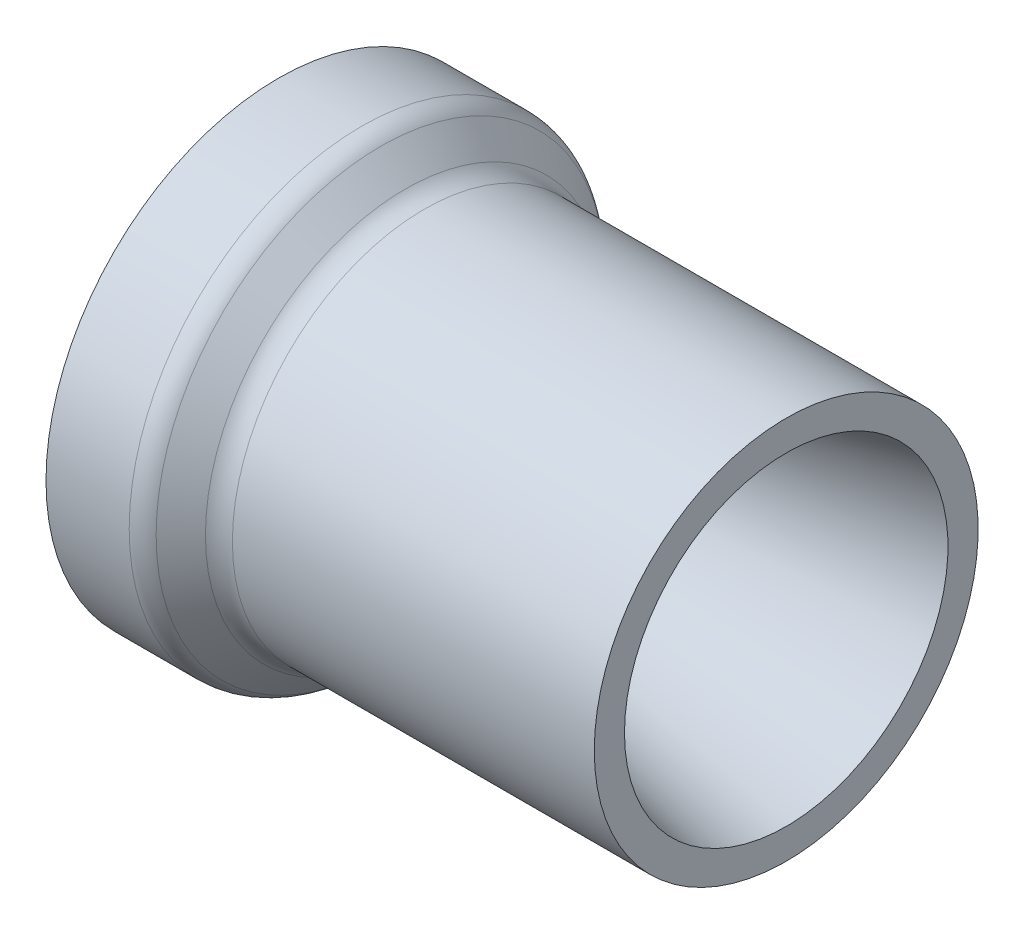
ISO-10303-21;
HEADER;
FILE_DESCRIPTION(('STEP AP214'),'2;1');
FILE_NAME('part.step','',(''),(''),'','','');
FILE_SCHEMA(('AUTOMOTIVE_DESIGN { 1 0 10303 214 1 1 1 1 }'));
ENDSEC;
DATA;
#1=APPLICATION_CONTEXT('core data for automotive mechanical design processes');
#2=APPLICATION_PROTOCOL_DEFINITION('international standard','automotive_design',2000,#1);
#3=PRODUCT_CONTEXT('',#1,'mechanical');
#4=PRODUCT('Part','Part','',(#3));
#5=PRODUCT_RELATED_PRODUCT_CATEGORY('part','',(#4));
#6=PRODUCT_DEFINITION_FORMATION('','',#4);
#7=PRODUCT_DEFINITION_CONTEXT('part definition',#1,'design');
#8=PRODUCT_DEFINITION('design','',#6,#7);
#9=PRODUCT_DEFINITION_SHAPE('','',#8);
#10=(LENGTH_UNIT() NAMED_UNIT(*) SI_UNIT(.MILLI.,.METRE.));
#11=(NAMED_UNIT(*) PLANE_ANGLE_UNIT() SI_UNIT($,.RADIAN.));
#12=(NAMED_UNIT(*) SI_UNIT($,.STERADIAN.) SOLID_ANGLE_UNIT());
#13=UNCERTAINTY_MEASURE_WITH_UNIT(LENGTH_MEASURE(1.E-05),#10,'distance_accuracy_value','');
#14=(GEOMETRIC_REPRESENTATION_CONTEXT(3) GLOBAL_UNCERTAINTY_ASSIGNED_CONTEXT((#13)) GLOBAL_UNIT_ASSIGNED_CONTEXT((#10,
#11,#12)) REPRESENTATION_CONTEXT('',''));
#15=CARTESIAN_POINT('',(0.,0.,0.));
#16=DIRECTION('',(0.,0.,1.));
#17=DIRECTION('',(1.,0.,0.));
#18=AXIS2_PLACEMENT_3D('',#15,#16,#17);
#19=CARTESIAN_POINT('',(24.0848719394654,55.0291,0.));
#20=DIRECTION('',(-1.,0.,0.));
#21=DIRECTION('',(0.,0.,1.));
#22=AXIS2_PLACEMENT_3D('',#19,#20,#21);
#23=CONICAL_SURFACE('',#22,52.8771280605346,0.78539816339745);
#24=CARTESIAN_POINT('',(29.8901280605346,55.0291,0.));
#25=DIRECTION('',(-1.,0.,0.));
#26=DIRECTION('',(0.,0.,1.));
#27=AXIS2_PLACEMENT_3D('',#24,#25,#26);
#28=CIRCLE('',#27,47.0718719394654);
#29=CARTESIAN_POINT('',(29.8901280605346,55.0291,47.0718719394654));
#30=VERTEX_POINT('',#29);
#31=EDGE_CURVE('E10',#30,#30,#28,.T.);
#32=ORIENTED_EDGE('',*,*,#31,.T.);
#33=EDGE_LOOP('',(#32));
#34=FACE_BOUND('',#33,.T.);
#35=CARTESIAN_POINT('',(24.0848719394654,55.0291,0.));
#36=DIRECTION('',(-1.,0.,0.));
#37=DIRECTION('',(0.,0.,1.));
#38=AXIS2_PLACEMENT_3D('',#35,#36,#37);
#39=CIRCLE('',#38,52.8771280605346);
#40=CARTESIAN_POINT('',(24.0848719394654,55.0291,52.8771280605346));
#41=VERTEX_POINT('',#40);
#42=EDGE_CURVE('E82',#41,#41,#39,.T.);
#43=ORIENTED_EDGE('',*,*,#42,.F.);
#44=EDGE_LOOP('',(#43));
#45=FACE_BOUND('',#44,.T.);
#46=ADVANCED_FACE('F39',(#34,#45),#23,.T.);
#47=CARTESIAN_POINT('',(34.3802561210692,55.0291,0.));
#48=DIRECTION('',(-1.,0.,0.));
#49=DIRECTION('',(0.,0.,1.));
#50=AXIS2_PLACEMENT_3D('',#47,#48,#49);
#51=TOROIDAL_SURFACE('',#50,51.562,6.35);
#52=CARTESIAN_POINT('',(34.3802561210692,55.0291,0.));
#53=DIRECTION('',(-1.,0.,0.));
#54=DIRECTION('',(0.,0.,1.));
#55=AXIS2_PLACEMENT_3D('',#52,#53,#54);
#56=CIRCLE('',#55,45.212);
#57=CARTESIAN_POINT('',(34.3802561210692,55.0291,45.212));
#58=VERTEX_POINT('',#57);
#59=EDGE_CURVE('E46',#58,#58,#56,.T.);
#60=ORIENTED_EDGE('',*,*,#59,.T.);
#61=EDGE_LOOP('',(#60));
#62=FACE_BOUND('',#61,.T.);
#63=ORIENTED_EDGE('',*,*,#31,.F.);
#64=EDGE_LOOP('',(#63));
#65=FACE_BOUND('',#64,.T.);
#66=ADVANCED_FACE('F91',(#62,#65),#51,.F.);
#67=CARTESIAN_POINT('',(0.,55.0291,0.));
#68=DIRECTION('',(-1.,0.,0.));
#69=DIRECTION('',(0.,0.,1.));
#70=AXIS2_PLACEMENT_3D('',#67,#68,#69);
#71=CYLINDRICAL_SURFACE('',#70,45.212);
#72=CARTESIAN_POINT('',(119.619043513692,55.0291,0.));
#73=DIRECTION('',(-1.,0.,0.));
#74=DIRECTION('',(0.,0.,1.));
#75=AXIS2_PLACEMENT_3D('',#72,#73,#74);
#76=CIRCLE('',#75,45.212);
#77=CARTESIAN_POINT('',(119.619043513692,55.0291,45.212));
#78=VERTEX_POINT('',#77);
#79=EDGE_CURVE('E51',#78,#78,#76,.T.);
#80=ORIENTED_EDGE('',*,*,#79,.T.);
#81=EDGE_LOOP('',(#80));
#82=FACE_BOUND('',#81,.T.);
#83=ORIENTED_EDGE('',*,*,#59,.F.);
#84=EDGE_LOOP('',(#83));
#85=FACE_BOUND('',#84,.T.);
#86=ADVANCED_FACE('F95',(#82,#85),#71,.T.);
#87=CARTESIAN_POINT('',(119.619043513692,0.,0.));
#88=DIRECTION('',(1.,0.,0.));
#89=DIRECTION('',(0.,0.,-1.));
#90=AXIS2_PLACEMENT_3D('',#87,#88,#89);
#91=PLANE('',#90);
#92=CARTESIAN_POINT('',(119.619043513692,55.0291,0.));
#93=DIRECTION('',(-1.,0.,0.));
#94=DIRECTION('',(0.,0.,1.));
#95=AXIS2_PLACEMENT_3D('',#92,#93,#94);
#96=CIRCLE('',#95,38.1);
#97=CARTESIAN_POINT('',(119.619043513692,55.0291,38.1));
#98=VERTEX_POINT('',#97);
#99=EDGE_CURVE('E56',#98,#98,#96,.T.);
#100=ORIENTED_EDGE('',*,*,#99,.T.);
#101=EDGE_LOOP('',(#100));
#102=FACE_BOUND('',#101,.T.);
#103=ORIENTED_EDGE('',*,*,#79,.F.);
#104=EDGE_LOOP('',(#103));
#105=FACE_BOUND('',#104,.T.);
#106=ADVANCED_FACE('F99',(#102,#105),#91,.T.);
#107=CARTESIAN_POINT('',(119.619043513692,55.0291,0.));
#108=DIRECTION('',(1.,0.,0.));
#109=DIRECTION('',(0.,0.,-1.));
#110=AXIS2_PLACEMENT_3D('',#107,#108,#109);
#111=CONICAL_SURFACE('',#110,38.1,0.209439510239313);
#112=CARTESIAN_POINT('',(24.0209596890868,55.0291,0.));
#113=DIRECTION('',(-1.,0.,0.));
#114=DIRECTION('',(0.,0.,1.));
#115=AXIS2_PLACEMENT_3D('',#112,#113,#114);
#116=CIRCLE('',#115,17.78);
#117=CARTESIAN_POINT('',(24.0209596890868,55.0291,17.78));
#118=VERTEX_POINT('',#117);
#119=EDGE_CURVE('E62',#118,#118,#116,.T.);
#120=ORIENTED_EDGE('',*,*,#119,.T.);
#121=EDGE_LOOP('',(#120));
#122=FACE_BOUND('',#121,.T.);
#123=ORIENTED_EDGE('',*,*,#99,.F.);
#124=EDGE_LOOP('',(#123));
#125=FACE_BOUND('',#124,.T.);
#126=ADVANCED_FACE('F106',(#122,#125),#111,.F.);
#127=CARTESIAN_POINT('',(0.,55.0291,0.));
#128=DIRECTION('',(-1.,0.,0.));
#129=DIRECTION('',(0.,0.,1.));
#130=AXIS2_PLACEMENT_3D('',#127,#128,#129);
#131=CYLINDRICAL_SURFACE('',#130,17.78);
#132=ORIENTED_EDGE('',*,*,#119,.F.);
#133=EDGE_LOOP('',(#132));
#134=FACE_BOUND('',#133,.T.);
#135=CARTESIAN_POINT('',(17.6709596890868,55.0291,0.));
#136=DIRECTION('',(-1.,0.,0.));
#137=DIRECTION('',(0.,0.,1.));
#138=AXIS2_PLACEMENT_3D('',#135,#136,#137);
#139=CIRCLE('',#138,17.78);
#140=CARTESIAN_POINT('',(17.6709596890868,55.0291,17.78));
#141=VERTEX_POINT('',#140);
#142=EDGE_CURVE('E66',#141,#141,#139,.T.);
#143=ORIENTED_EDGE('',*,*,#142,.T.);
#144=EDGE_LOOP('',(#143));
#145=FACE_BOUND('',#144,.T.);
#146=ADVANCED_FACE('F110',(#134,#145),#131,.F.);
#147=CARTESIAN_POINT('',(0.,55.0291,0.));
#148=DIRECTION('',(-1.,0.,0.));
#149=DIRECTION('',(0.,0.,1.));
#150=AXIS2_PLACEMENT_3D('',#147,#148,#149);
#151=CONICAL_SURFACE('',#150,48.387,1.0471975511966);
#152=ORIENTED_EDGE('',*,*,#142,.F.);
#153=EDGE_LOOP('',(#152));
#154=FACE_BOUND('',#153,.T.);
#155=CARTESIAN_POINT('',(0.,55.0291,0.));
#156=DIRECTION('',(-1.,0.,0.));
#157=DIRECTION('',(0.,0.,1.));
#158=AXIS2_PLACEMENT_3D('',#155,#156,#157);
#159=CIRCLE('',#158,48.387);
#160=CARTESIAN_POINT('',(0.,55.0291,48.387));
#161=VERTEX_POINT('',#160);
#162=EDGE_CURVE('E70',#161,#161,#159,.T.);
#163=ORIENTED_EDGE('',*,*,#162,.T.);
#164=EDGE_LOOP('',(#163));
#165=FACE_BOUND('',#164,.T.);
#166=ADVANCED_FACE('F114',(#154,#165),#151,.F.);
#167=CARTESIAN_POINT('',(0.,0.,0.));
#168=DIRECTION('',(1.,0.,0.));
#169=DIRECTION('',(0.,0.,-1.));
#170=AXIS2_PLACEMENT_3D('',#167,#168,#169);
#171=PLANE('',#170);
#172=ORIENTED_EDGE('',*,*,#162,.F.);
#173=EDGE_LOOP('',(#172));
#174=FACE_BOUND('',#173,.T.);
#175=CARTESIAN_POINT('',(0.,55.0291,0.));
#176=DIRECTION('',(-1.,0.,0.));
#177=DIRECTION('',(0.,0.,1.));
#178=AXIS2_PLACEMENT_3D('',#175,#176,#177);
#179=CIRCLE('',#178,54.737);
#180=CARTESIAN_POINT('',(0.,55.0291,54.737));
#181=VERTEX_POINT('',#180);
#182=EDGE_CURVE('E74',#181,#181,#179,.T.);
#183=ORIENTED_EDGE('',*,*,#182,.T.);
#184=EDGE_LOOP('',(#183));
#185=FACE_BOUND('',#184,.T.);
#186=ADVANCED_FACE('F118',(#174,#185),#171,.F.);
#187=CARTESIAN_POINT('',(0.,55.0291,0.));
#188=DIRECTION('',(-1.,0.,0.));
#189=DIRECTION('',(0.,0.,1.));
#190=AXIS2_PLACEMENT_3D('',#187,#188,#189);
#191=CYLINDRICAL_SURFACE('',#190,54.737);
#192=CARTESIAN_POINT('',(19.5947438789308,55.0291,0.));
#193=DIRECTION('',(-1.,0.,0.));
#194=DIRECTION('',(0.,0.,1.));
#195=AXIS2_PLACEMENT_3D('',#192,#193,#194);
#196=CIRCLE('',#195,54.737);
#197=CARTESIAN_POINT('',(19.5947438789308,55.0291,54.737));
#198=VERTEX_POINT('',#197);
#199=EDGE_CURVE('E78',#198,#198,#196,.T.);
#200=ORIENTED_EDGE('',*,*,#199,.T.);
#201=EDGE_LOOP('',(#200));
#202=FACE_BOUND('',#201,.T.);
#203=ORIENTED_EDGE('',*,*,#182,.F.);
#204=EDGE_LOOP('',(#203));
#205=FACE_BOUND('',#204,.T.);
#206=ADVANCED_FACE('F122',(#202,#205),#191,.T.);
#207=CARTESIAN_POINT('',(19.5947438789308,55.0291,0.));
#208=DIRECTION('',(-1.,0.,0.));
#209=DIRECTION('',(0.,0.,1.));
#210=AXIS2_PLACEMENT_3D('',#207,#208,#209);
#211=TOROIDAL_SURFACE('',#210,48.387,6.35);
#212=ORIENTED_EDGE('',*,*,#42,.T.);
#213=EDGE_LOOP('',(#212));
#214=FACE_BOUND('',#213,.T.);
#215=ORIENTED_EDGE('',*,*,#199,.F.);
#216=EDGE_LOOP('',(#215));
#217=FACE_BOUND('',#216,.T.);
#218=ADVANCED_FACE('F87',(#214,#217),#211,.T.);
#219=CLOSED_SHELL('',(#46,#66,#86,#106,#126,#146,#166,#186,#206,#218));
#220=MANIFOLD_SOLID_BREP('B2',#219);
#221=ADVANCED_BREP_SHAPE_REPRESENTATION('',(#18,#220),#14);
#222=SHAPE_DEFINITION_REPRESENTATION(#9,#221);
ENDSEC;
END-ISO-10303-21;
